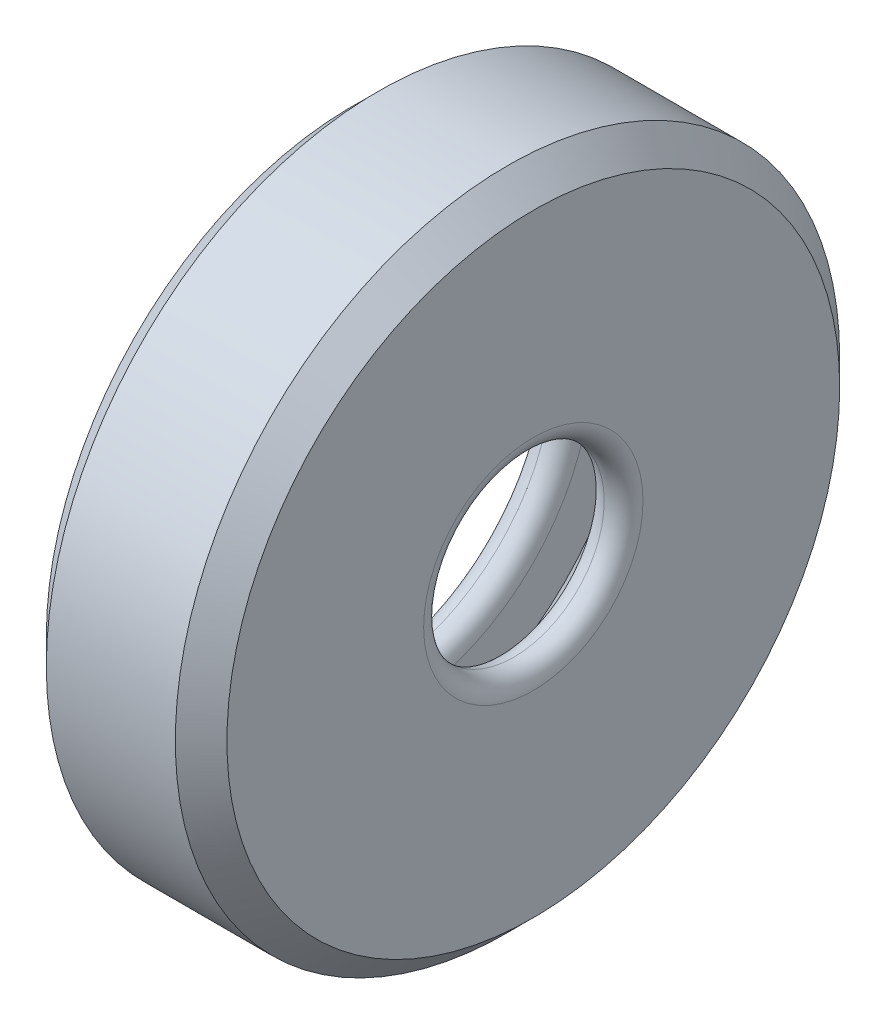
ISO-10303-21;
HEADER;
FILE_DESCRIPTION(('STEP AP214'),'2;1');
FILE_NAME('part.step','',(''),(''),'','','');
FILE_SCHEMA(('AUTOMOTIVE_DESIGN { 1 0 10303 214 1 1 1 1 }'));
ENDSEC;
DATA;
#1=APPLICATION_CONTEXT('core data for automotive mechanical design processes');
#2=APPLICATION_PROTOCOL_DEFINITION('international standard','automotive_design',2000,#1);
#3=PRODUCT_CONTEXT('',#1,'mechanical');
#4=PRODUCT('Part','Part','',(#3));
#5=PRODUCT_RELATED_PRODUCT_CATEGORY('part','',(#4));
#6=PRODUCT_DEFINITION_FORMATION('','',#4);
#7=PRODUCT_DEFINITION_CONTEXT('part definition',#1,'design');
#8=PRODUCT_DEFINITION('design','',#6,#7);
#9=PRODUCT_DEFINITION_SHAPE('','',#8);
#10=(LENGTH_UNIT() NAMED_UNIT(*) SI_UNIT(.MILLI.,.METRE.));
#11=(NAMED_UNIT(*) PLANE_ANGLE_UNIT() SI_UNIT($,.RADIAN.));
#12=(NAMED_UNIT(*) SI_UNIT($,.STERADIAN.) SOLID_ANGLE_UNIT());
#13=UNCERTAINTY_MEASURE_WITH_UNIT(LENGTH_MEASURE(1.E-05),#10,'distance_accuracy_value','');
#14=(GEOMETRIC_REPRESENTATION_CONTEXT(3) GLOBAL_UNCERTAINTY_ASSIGNED_CONTEXT((#13)) GLOBAL_UNIT_ASSIGNED_CONTEXT((#10,
#11,#12)) REPRESENTATION_CONTEXT('',''));
#15=CARTESIAN_POINT('',(0.,0.,0.));
#16=DIRECTION('',(0.,0.,1.));
#17=DIRECTION('',(1.,0.,0.));
#18=AXIS2_PLACEMENT_3D('',#15,#16,#17);
#19=CARTESIAN_POINT('',(-7.,14.,0.));
#20=DIRECTION('',(-1.,0.,0.));
#21=DIRECTION('',(0.,0.,1.));
#22=AXIS2_PLACEMENT_3D('',#19,#20,#21);
#23=PLANE('',#22);
#24=CARTESIAN_POINT('',(-7.,0.,0.));
#25=DIRECTION('',(-1.,0.,0.));
#26=DIRECTION('',(0.,0.,1.));
#27=AXIS2_PLACEMENT_3D('',#24,#25,#26);
#28=CIRCLE('',#27,15.5);
#29=CARTESIAN_POINT('',(-7.,0.,15.5));
#30=VERTEX_POINT('',#29);
#31=EDGE_CURVE('E39',#30,#30,#28,.F.);
#32=ORIENTED_EDGE('',*,*,#31,.T.);
#33=EDGE_LOOP('',(#32));
#34=FACE_BOUND('',#33,.T.);
#35=CARTESIAN_POINT('',(-7.,0.,0.));
#36=DIRECTION('',(-1.,0.,0.));
#37=DIRECTION('',(0.,0.,1.));
#38=AXIS2_PLACEMENT_3D('',#35,#36,#37);
#39=CIRCLE('',#38,23.75);
#40=CARTESIAN_POINT('',(-7.,0.,23.75));
#41=VERTEX_POINT('',#40);
#42=EDGE_CURVE('E115',#41,#41,#39,.T.);
#43=ORIENTED_EDGE('',*,*,#42,.T.);
#44=EDGE_LOOP('',(#43));
#45=FACE_BOUND('',#44,.T.);
#46=ADVANCED_FACE('F31',(#34,#45),#23,.T.);
#47=CARTESIAN_POINT('',(0.,0.,0.));
#48=DIRECTION('',(1.,0.,0.));
#49=DIRECTION('',(0.,0.,-1.));
#50=AXIS2_PLACEMENT_3D('',#47,#48,#49);
#51=CYLINDRICAL_SURFACE('',#50,25.75);
#52=CARTESIAN_POINT('',(-5.,0.,0.));
#53=DIRECTION('',(-1.,0.,0.));
#54=DIRECTION('',(0.,0.,1.));
#55=AXIS2_PLACEMENT_3D('',#52,#53,#54);
#56=CIRCLE('',#55,25.75);
#57=CARTESIAN_POINT('',(-5.,0.,25.75));
#58=VERTEX_POINT('',#57);
#59=EDGE_CURVE('E118',#58,#58,#56,.F.);
#60=ORIENTED_EDGE('',*,*,#59,.T.);
#61=EDGE_LOOP('',(#60));
#62=FACE_BOUND('',#61,.T.);
#63=CARTESIAN_POINT('',(4.99999999999999,0.,0.));
#64=DIRECTION('',(1.,0.,0.));
#65=DIRECTION('',(0.,0.,-1.));
#66=AXIS2_PLACEMENT_3D('',#63,#64,#65);
#67=CIRCLE('',#66,25.75);
#68=CARTESIAN_POINT('',(4.99999999999999,0.,-25.75));
#69=VERTEX_POINT('',#68);
#70=EDGE_CURVE('E121',#69,#69,#67,.F.);
#71=ORIENTED_EDGE('',*,*,#70,.T.);
#72=EDGE_LOOP('',(#71));
#73=FACE_BOUND('',#72,.T.);
#74=ADVANCED_FACE('F71',(#62,#73),#51,.T.);
#75=CARTESIAN_POINT('',(7.,7.,0.));
#76=DIRECTION('',(1.,0.,0.));
#77=DIRECTION('',(0.,0.,-1.));
#78=AXIS2_PLACEMENT_3D('',#75,#76,#77);
#79=PLANE('',#78);
#80=CARTESIAN_POINT('',(7.,0.,0.));
#81=DIRECTION('',(1.,0.,0.));
#82=DIRECTION('',(0.,0.,-1.));
#83=AXIS2_PLACEMENT_3D('',#80,#81,#82);
#84=CIRCLE('',#83,8.5);
#85=CARTESIAN_POINT('',(7.,0.,-8.5));
#86=VERTEX_POINT('',#85);
#87=EDGE_CURVE('E44',#86,#86,#84,.F.);
#88=ORIENTED_EDGE('',*,*,#87,.T.);
#89=EDGE_LOOP('',(#88));
#90=FACE_BOUND('',#89,.T.);
#91=CARTESIAN_POINT('',(7.,0.,0.));
#92=DIRECTION('',(1.,0.,0.));
#93=DIRECTION('',(0.,0.,-1.));
#94=AXIS2_PLACEMENT_3D('',#91,#92,#93);
#95=CIRCLE('',#94,23.75);
#96=CARTESIAN_POINT('',(7.,0.,-23.75));
#97=VERTEX_POINT('',#96);
#98=EDGE_CURVE('E110',#97,#97,#95,.T.);
#99=ORIENTED_EDGE('',*,*,#98,.T.);
#100=EDGE_LOOP('',(#99));
#101=FACE_BOUND('',#100,.T.);
#102=ADVANCED_FACE('F77',(#90,#101),#79,.T.);
#103=CARTESIAN_POINT('',(4.,14.,0.));
#104=DIRECTION('',(-1.,0.,0.));
#105=DIRECTION('',(0.,0.,1.));
#106=AXIS2_PLACEMENT_3D('',#103,#104,#105);
#107=PLANE('',#106);
#108=CARTESIAN_POINT('',(4.,0.,0.));
#109=DIRECTION('',(-1.,0.,0.));
#110=DIRECTION('',(0.,0.,1.));
#111=AXIS2_PLACEMENT_3D('',#108,#109,#110);
#112=CIRCLE('',#111,8.5);
#113=CARTESIAN_POINT('',(4.,0.,8.5));
#114=VERTEX_POINT('',#113);
#115=EDGE_CURVE('E108',#114,#114,#112,.F.);
#116=ORIENTED_EDGE('',*,*,#115,.T.);
#117=EDGE_LOOP('',(#116));
#118=FACE_BOUND('',#117,.T.);
#119=CARTESIAN_POINT('',(4.,0.,0.));
#120=DIRECTION('',(-1.,0.,0.));
#121=DIRECTION('',(0.,0.,1.));
#122=AXIS2_PLACEMENT_3D('',#119,#120,#121);
#123=CIRCLE('',#122,19.);
#124=CARTESIAN_POINT('',(4.,0.,19.));
#125=VERTEX_POINT('',#124);
#126=EDGE_CURVE('E124',#125,#125,#123,.T.);
#127=ORIENTED_EDGE('',*,*,#126,.T.);
#128=EDGE_LOOP('',(#127));
#129=FACE_BOUND('',#128,.T.);
#130=ADVANCED_FACE('F136',(#118,#129),#107,.T.);
#131=CARTESIAN_POINT('',(0.,0.,0.));
#132=DIRECTION('',(1.,0.,0.));
#133=DIRECTION('',(0.,0.,-1.));
#134=AXIS2_PLACEMENT_3D('',#131,#132,#133);
#135=CYLINDRICAL_SURFACE('',#134,21.);
#136=CARTESIAN_POINT('',(-2.,0.,0.));
#137=DIRECTION('',(1.,0.,0.));
#138=DIRECTION('',(0.,0.,-1.));
#139=AXIS2_PLACEMENT_3D('',#136,#137,#138);
#140=CIRCLE('',#139,21.);
#141=CARTESIAN_POINT('',(-2.,0.,-21.));
#142=VERTEX_POINT('',#141);
#143=EDGE_CURVE('E127',#142,#142,#140,.F.);
#144=ORIENTED_EDGE('',*,*,#143,.T.);
#145=EDGE_LOOP('',(#144));
#146=FACE_BOUND('',#145,.T.);
#147=CARTESIAN_POINT('',(1.99999999999999,0.,0.));
#148=DIRECTION('',(-1.,0.,0.));
#149=DIRECTION('',(0.,0.,1.));
#150=AXIS2_PLACEMENT_3D('',#147,#148,#149);
#151=CIRCLE('',#150,21.);
#152=CARTESIAN_POINT('',(1.99999999999999,0.,21.));
#153=VERTEX_POINT('',#152);
#154=EDGE_CURVE('E53',#153,#153,#151,.F.);
#155=ORIENTED_EDGE('',*,*,#154,.T.);
#156=EDGE_LOOP('',(#155));
#157=FACE_BOUND('',#156,.T.);
#158=ADVANCED_FACE('F133',(#146,#157),#135,.F.);
#159=CARTESIAN_POINT('',(-4.,21.,0.));
#160=DIRECTION('',(1.,0.,0.));
#161=DIRECTION('',(0.,0.,-1.));
#162=AXIS2_PLACEMENT_3D('',#159,#160,#161);
#163=PLANE('',#162);
#164=CARTESIAN_POINT('',(-4.,0.,0.));
#165=DIRECTION('',(1.,0.,0.));
#166=DIRECTION('',(0.,0.,-1.));
#167=AXIS2_PLACEMENT_3D('',#164,#165,#166);
#168=CIRCLE('',#167,15.5);
#169=CARTESIAN_POINT('',(-4.,0.,-15.5));
#170=VERTEX_POINT('',#169);
#171=EDGE_CURVE('E10',#170,#170,#168,.F.);
#172=ORIENTED_EDGE('',*,*,#171,.T.);
#173=EDGE_LOOP('',(#172));
#174=FACE_BOUND('',#173,.T.);
#175=CARTESIAN_POINT('',(-4.,0.,0.));
#176=DIRECTION('',(1.,0.,0.));
#177=DIRECTION('',(0.,0.,-1.));
#178=AXIS2_PLACEMENT_3D('',#175,#176,#177);
#179=CIRCLE('',#178,19.);
#180=CARTESIAN_POINT('',(-4.,0.,-19.));
#181=VERTEX_POINT('',#180);
#182=EDGE_CURVE('E49',#181,#181,#179,.T.);
#183=ORIENTED_EDGE('',*,*,#182,.T.);
#184=EDGE_LOOP('',(#183));
#185=FACE_BOUND('',#184,.T.);
#186=ADVANCED_FACE('F87',(#174,#185),#163,.T.);
#187=CARTESIAN_POINT('',(-4.,0.,0.));
#188=DIRECTION('',(1.,0.,0.));
#189=DIRECTION('',(0.,0.,-1.));
#190=AXIS2_PLACEMENT_3D('',#187,#188,#189);
#191=CONICAL_SURFACE('',#190,19.,0.785398163397455);
#192=ORIENTED_EDGE('',*,*,#143,.F.);
#193=EDGE_LOOP('',(#192));
#194=FACE_BOUND('',#193,.T.);
#195=ORIENTED_EDGE('',*,*,#182,.F.);
#196=EDGE_LOOP('',(#195));
#197=FACE_BOUND('',#196,.T.);
#198=ADVANCED_FACE('F83',(#194,#197),#191,.F.);
#199=CARTESIAN_POINT('',(1.99999999999999,0.,0.));
#200=DIRECTION('',(-1.,0.,0.));
#201=DIRECTION('',(0.,0.,1.));
#202=AXIS2_PLACEMENT_3D('',#199,#200,#201);
#203=CONICAL_SURFACE('',#202,21.,0.785398163397443);
#204=ORIENTED_EDGE('',*,*,#126,.F.);
#205=EDGE_LOOP('',(#204));
#206=FACE_BOUND('',#205,.T.);
#207=ORIENTED_EDGE('',*,*,#154,.F.);
#208=EDGE_LOOP('',(#207));
#209=FACE_BOUND('',#208,.T.);
#210=ADVANCED_FACE('F86',(#206,#209),#203,.F.);
#211=CARTESIAN_POINT('',(-5.,0.,0.));
#212=DIRECTION('',(1.,0.,0.));
#213=DIRECTION('',(0.,0.,-1.));
#214=AXIS2_PLACEMENT_3D('',#211,#212,#213);
#215=CONICAL_SURFACE('',#214,25.75,0.78539816339745);
#216=ORIENTED_EDGE('',*,*,#42,.F.);
#217=EDGE_LOOP('',(#216));
#218=FACE_BOUND('',#217,.T.);
#219=ORIENTED_EDGE('',*,*,#59,.F.);
#220=EDGE_LOOP('',(#219));
#221=FACE_BOUND('',#220,.T.);
#222=ADVANCED_FACE('F91',(#218,#221),#215,.T.);
#223=CARTESIAN_POINT('',(7.,0.,0.));
#224=DIRECTION('',(-1.,0.,0.));
#225=DIRECTION('',(0.,0.,1.));
#226=AXIS2_PLACEMENT_3D('',#223,#224,#225);
#227=CONICAL_SURFACE('',#226,23.75,0.785398163397445);
#228=ORIENTED_EDGE('',*,*,#70,.F.);
#229=EDGE_LOOP('',(#228));
#230=FACE_BOUND('',#229,.T.);
#231=ORIENTED_EDGE('',*,*,#98,.F.);
#232=EDGE_LOOP('',(#231));
#233=FACE_BOUND('',#232,.T.);
#234=ADVANCED_FACE('F95',(#230,#233),#227,.T.);
#235=CARTESIAN_POINT('',(5.5,0.,0.));
#236=DIRECTION('',(1.,0.,0.));
#237=DIRECTION('',(0.,0.,-1.));
#238=AXIS2_PLACEMENT_3D('',#235,#236,#237);
#239=TOROIDAL_SURFACE('',#238,8.5,1.5);
#240=ORIENTED_EDGE('',*,*,#87,.F.);
#241=EDGE_LOOP('',(#240));
#242=FACE_BOUND('',#241,.T.);
#243=CARTESIAN_POINT('',(5.5,0.,0.));
#244=DIRECTION('',(1.,0.,0.));
#245=DIRECTION('',(0.,0.,-1.));
#246=AXIS2_PLACEMENT_3D('',#243,#244,#245);
#247=CIRCLE('',#246,7.);
#248=CARTESIAN_POINT('',(5.5,0.,-7.));
#249=VERTEX_POINT('',#248);
#250=EDGE_CURVE('E47',#249,#249,#247,.T.);
#251=ORIENTED_EDGE('',*,*,#250,.F.);
#252=EDGE_LOOP('',(#251));
#253=FACE_BOUND('',#252,.T.);
#254=ADVANCED_FACE('F68',(#242,#253),#239,.T.);
#255=CARTESIAN_POINT('',(5.5,0.,0.));
#256=DIRECTION('',(-1.,0.,0.));
#257=DIRECTION('',(0.,0.,1.));
#258=AXIS2_PLACEMENT_3D('',#255,#256,#257);
#259=TOROIDAL_SURFACE('',#258,8.5,1.5);
#260=ORIENTED_EDGE('',*,*,#250,.T.);
#261=EDGE_LOOP('',(#260));
#262=FACE_BOUND('',#261,.T.);
#263=ORIENTED_EDGE('',*,*,#115,.F.);
#264=EDGE_LOOP('',(#263));
#265=FACE_BOUND('',#264,.T.);
#266=ADVANCED_FACE('F62',(#262,#265),#259,.T.);
#267=CARTESIAN_POINT('',(-5.5,0.,0.));
#268=DIRECTION('',(1.,0.,0.));
#269=DIRECTION('',(0.,0.,-1.));
#270=AXIS2_PLACEMENT_3D('',#267,#268,#269);
#271=TOROIDAL_SURFACE('',#270,15.5,1.5);
#272=ORIENTED_EDGE('',*,*,#171,.F.);
#273=EDGE_LOOP('',(#272));
#274=FACE_BOUND('',#273,.T.);
#275=CARTESIAN_POINT('',(-5.5,0.,0.));
#276=DIRECTION('',(1.,0.,0.));
#277=DIRECTION('',(0.,0.,-1.));
#278=AXIS2_PLACEMENT_3D('',#275,#276,#277);
#279=CIRCLE('',#278,14.);
#280=CARTESIAN_POINT('',(-5.5,0.,-14.));
#281=VERTEX_POINT('',#280);
#282=EDGE_CURVE('E35',#281,#281,#279,.T.);
#283=ORIENTED_EDGE('',*,*,#282,.F.);
#284=EDGE_LOOP('',(#283));
#285=FACE_BOUND('',#284,.T.);
#286=ADVANCED_FACE('F33',(#274,#285),#271,.T.);
#287=CARTESIAN_POINT('',(-5.5,0.,0.));
#288=DIRECTION('',(-1.,0.,0.));
#289=DIRECTION('',(0.,0.,1.));
#290=AXIS2_PLACEMENT_3D('',#287,#288,#289);
#291=TOROIDAL_SURFACE('',#290,15.5,1.5);
#292=ORIENTED_EDGE('',*,*,#282,.T.);
#293=EDGE_LOOP('',(#292));
#294=FACE_BOUND('',#293,.T.);
#295=ORIENTED_EDGE('',*,*,#31,.F.);
#296=EDGE_LOOP('',(#295));
#297=FACE_BOUND('',#296,.T.);
#298=ADVANCED_FACE('F58',(#294,#297),#291,.T.);
#299=CLOSED_SHELL('',(#46,#74,#102,#130,#158,#186,#198,#210,#222,#234,#254,#266,#286,#298));
#300=MANIFOLD_SOLID_BREP('B2',#299);
#301=ADVANCED_BREP_SHAPE_REPRESENTATION('',(#18,#300),#14);
#302=SHAPE_DEFINITION_REPRESENTATION(#9,#301);
ENDSEC;
END-ISO-10303-21;
